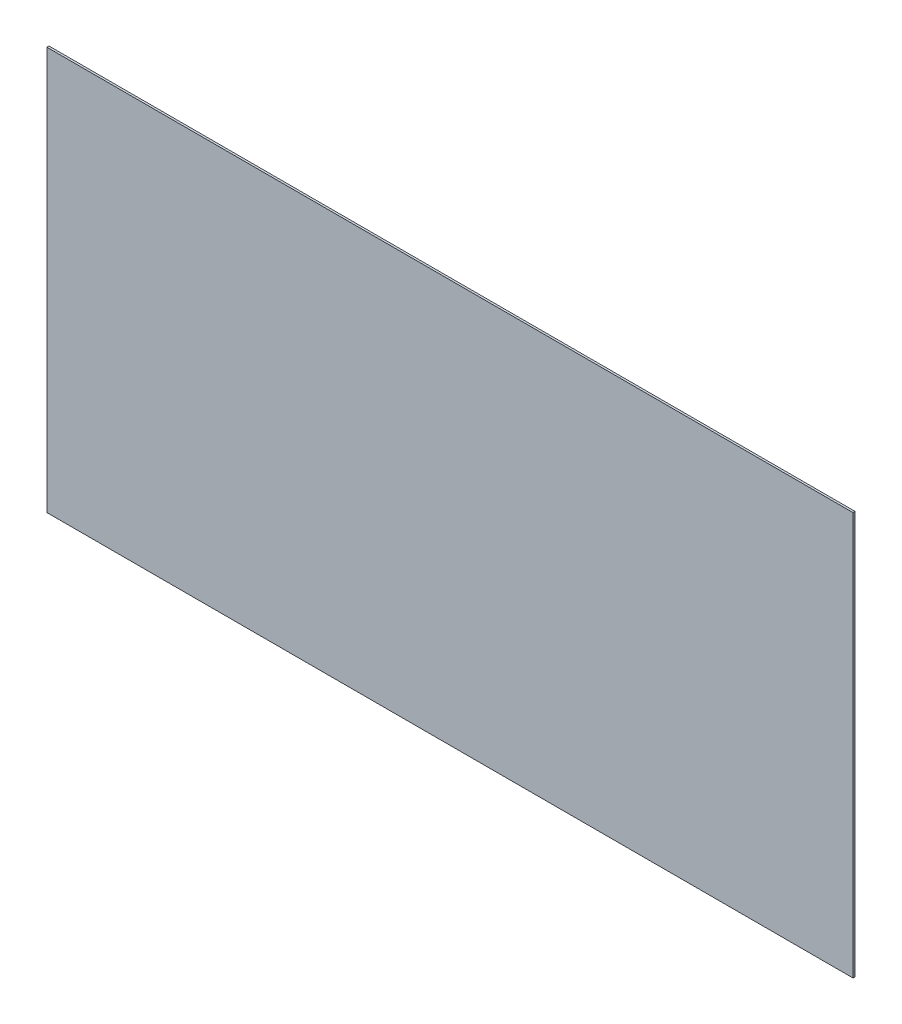
ISO-10303-21;
HEADER;
FILE_DESCRIPTION(('STEP AP214'),'2;1');
FILE_NAME('part.step','',(''),(''),'','','');
FILE_SCHEMA(('AUTOMOTIVE_DESIGN { 1 0 10303 214 1 1 1 1 }'));
ENDSEC;
DATA;
#1=APPLICATION_CONTEXT('core data for automotive mechanical design processes');
#2=APPLICATION_PROTOCOL_DEFINITION('international standard','automotive_design',2000,#1);
#3=PRODUCT_CONTEXT('',#1,'mechanical');
#4=PRODUCT('Part','Part','',(#3));
#5=PRODUCT_RELATED_PRODUCT_CATEGORY('part','',(#4));
#6=PRODUCT_DEFINITION_FORMATION('','',#4);
#7=PRODUCT_DEFINITION_CONTEXT('part definition',#1,'design');
#8=PRODUCT_DEFINITION('design','',#6,#7);
#9=PRODUCT_DEFINITION_SHAPE('','',#8);
#10=(LENGTH_UNIT() NAMED_UNIT(*) SI_UNIT(.MILLI.,.METRE.));
#11=(NAMED_UNIT(*) PLANE_ANGLE_UNIT() SI_UNIT($,.RADIAN.));
#12=(NAMED_UNIT(*) SI_UNIT($,.STERADIAN.) SOLID_ANGLE_UNIT());
#13=UNCERTAINTY_MEASURE_WITH_UNIT(LENGTH_MEASURE(1.E-05),#10,'distance_accuracy_value','');
#14=(GEOMETRIC_REPRESENTATION_CONTEXT(3) GLOBAL_UNCERTAINTY_ASSIGNED_CONTEXT((#13)) GLOBAL_UNIT_ASSIGNED_CONTEXT((#10,
#11,#12)) REPRESENTATION_CONTEXT('',''));
#15=CARTESIAN_POINT('',(0.,0.,0.));
#16=DIRECTION('',(0.,0.,1.));
#17=DIRECTION('',(1.,0.,0.));
#18=AXIS2_PLACEMENT_3D('',#15,#16,#17);
#19=CARTESIAN_POINT('',(0.,0.,4.7625));
#20=DIRECTION('',(0.,0.,1.));
#21=DIRECTION('',(1.,0.,0.));
#22=AXIS2_PLACEMENT_3D('',#19,#20,#21);
#23=PLANE('',#22);
#24=DIRECTION('',(1.,0.,0.));
#25=VECTOR('',#24,1.);
#26=CARTESIAN_POINT('',(914.4,914.4,4.7625));
#27=LINE('',#26,#25);
#28=CARTESIAN_POINT('',(-914.4,914.4,4.7625));
#29=VERTEX_POINT('',#28);
#30=CARTESIAN_POINT('',(914.4,914.4,4.7625));
#31=VERTEX_POINT('',#30);
#32=EDGE_CURVE('E68',#29,#31,#27,.T.);
#33=ORIENTED_EDGE('',*,*,#32,.F.);
#34=DIRECTION('',(0.,1.,0.));
#35=VECTOR('',#34,1.);
#36=CARTESIAN_POINT('',(-914.4,914.4,4.7625));
#37=LINE('',#36,#35);
#38=CARTESIAN_POINT('',(-914.4,0.,4.7625));
#39=VERTEX_POINT('',#38);
#40=EDGE_CURVE('E20',#39,#29,#37,.T.);
#41=ORIENTED_EDGE('',*,*,#40,.F.);
#42=DIRECTION('',(1.,0.,0.));
#43=VECTOR('',#42,1.);
#44=CARTESIAN_POINT('',(-914.4,0.,4.7625));
#45=LINE('',#44,#43);
#46=CARTESIAN_POINT('',(914.4,0.,4.7625));
#47=VERTEX_POINT('',#46);
#48=EDGE_CURVE('E58',#47,#39,#45,.F.);
#49=ORIENTED_EDGE('',*,*,#48,.F.);
#50=DIRECTION('',(0.,1.,0.));
#51=VECTOR('',#50,1.);
#52=CARTESIAN_POINT('',(914.4,0.,4.7625));
#53=LINE('',#52,#51);
#54=EDGE_CURVE('E53',#31,#47,#53,.F.);
#55=ORIENTED_EDGE('',*,*,#54,.F.);
#56=EDGE_LOOP('',(#33,#41,#49,#55));
#57=FACE_BOUND('',#56,.T.);
#58=ADVANCED_FACE('F17',(#57),#23,.T.);
#59=CARTESIAN_POINT('',(-914.4,914.4,0.));
#60=DIRECTION('',(-1.,0.,0.));
#61=DIRECTION('',(0.,0.,1.));
#62=AXIS2_PLACEMENT_3D('',#59,#60,#61);
#63=PLANE('',#62);
#64=DIRECTION('',(0.,0.,1.));
#65=VECTOR('',#64,1.);
#66=CARTESIAN_POINT('',(-914.4,914.4,0.));
#67=LINE('',#66,#65);
#68=CARTESIAN_POINT('',(-914.4,914.4,0.));
#69=VERTEX_POINT('',#68);
#70=EDGE_CURVE('E79',#69,#29,#67,.T.);
#71=ORIENTED_EDGE('',*,*,#70,.F.);
#72=DIRECTION('',(0.,1.,0.));
#73=VECTOR('',#72,1.);
#74=CARTESIAN_POINT('',(-914.4,0.,0.));
#75=LINE('',#74,#73);
#76=CARTESIAN_POINT('',(-914.4,0.,0.));
#77=VERTEX_POINT('',#76);
#78=EDGE_CURVE('E74',#69,#77,#75,.F.);
#79=ORIENTED_EDGE('',*,*,#78,.T.);
#80=DIRECTION('',(0.,0.,-1.));
#81=VECTOR('',#80,1.);
#82=CARTESIAN_POINT('',(-914.4,0.,0.));
#83=LINE('',#82,#81);
#84=EDGE_CURVE('E63',#39,#77,#83,.T.);
#85=ORIENTED_EDGE('',*,*,#84,.F.);
#86=ORIENTED_EDGE('',*,*,#40,.T.);
#87=EDGE_LOOP('',(#71,#79,#85,#86));
#88=FACE_BOUND('',#87,.T.);
#89=ADVANCED_FACE('F73',(#88),#63,.T.);
#90=CARTESIAN_POINT('',(-914.4,0.,0.));
#91=DIRECTION('',(0.,-1.,0.));
#92=DIRECTION('',(0.,0.,-1.));
#93=AXIS2_PLACEMENT_3D('',#90,#91,#92);
#94=PLANE('',#93);
#95=ORIENTED_EDGE('',*,*,#84,.T.);
#96=DIRECTION('',(1.,0.,0.));
#97=VECTOR('',#96,1.);
#98=CARTESIAN_POINT('',(0.,0.,0.));
#99=LINE('',#98,#97);
#100=CARTESIAN_POINT('',(914.4,0.,0.));
#101=VERTEX_POINT('',#100);
#102=EDGE_CURVE('E84',#77,#101,#99,.T.);
#103=ORIENTED_EDGE('',*,*,#102,.T.);
#104=DIRECTION('',(0.,0.,-1.));
#105=VECTOR('',#104,1.);
#106=CARTESIAN_POINT('',(914.4,0.,0.));
#107=LINE('',#106,#105);
#108=EDGE_CURVE('E65',#47,#101,#107,.T.);
#109=ORIENTED_EDGE('',*,*,#108,.F.);
#110=ORIENTED_EDGE('',*,*,#48,.T.);
#111=EDGE_LOOP('',(#95,#103,#109,#110));
#112=FACE_BOUND('',#111,.T.);
#113=ADVANCED_FACE('F60',(#112),#94,.T.);
#114=CARTESIAN_POINT('',(914.4,0.,0.));
#115=DIRECTION('',(1.,0.,0.));
#116=DIRECTION('',(0.,0.,-1.));
#117=AXIS2_PLACEMENT_3D('',#114,#115,#116);
#118=PLANE('',#117);
#119=ORIENTED_EDGE('',*,*,#108,.T.);
#120=DIRECTION('',(0.,1.,0.));
#121=VECTOR('',#120,1.);
#122=CARTESIAN_POINT('',(914.4,0.,0.));
#123=LINE('',#122,#121);
#124=CARTESIAN_POINT('',(914.4,914.4,0.));
#125=VERTEX_POINT('',#124);
#126=EDGE_CURVE('E26',#101,#125,#123,.T.);
#127=ORIENTED_EDGE('',*,*,#126,.T.);
#128=DIRECTION('',(0.,0.,1.));
#129=VECTOR('',#128,1.);
#130=CARTESIAN_POINT('',(914.4,914.4,0.));
#131=LINE('',#130,#129);
#132=EDGE_CURVE('E34',#31,#125,#131,.F.);
#133=ORIENTED_EDGE('',*,*,#132,.F.);
#134=ORIENTED_EDGE('',*,*,#54,.T.);
#135=EDGE_LOOP('',(#119,#127,#133,#134));
#136=FACE_BOUND('',#135,.T.);
#137=ADVANCED_FACE('F88',(#136),#118,.T.);
#138=CARTESIAN_POINT('',(914.4,914.4,0.));
#139=DIRECTION('',(0.,1.,0.));
#140=DIRECTION('',(0.,0.,1.));
#141=AXIS2_PLACEMENT_3D('',#138,#139,#140);
#142=PLANE('',#141);
#143=ORIENTED_EDGE('',*,*,#132,.T.);
#144=DIRECTION('',(1.,0.,0.));
#145=VECTOR('',#144,1.);
#146=CARTESIAN_POINT('',(0.,914.4,0.));
#147=LINE('',#146,#145);
#148=EDGE_CURVE('E11',#125,#69,#147,.F.);
#149=ORIENTED_EDGE('',*,*,#148,.T.);
#150=ORIENTED_EDGE('',*,*,#70,.T.);
#151=ORIENTED_EDGE('',*,*,#32,.T.);
#152=EDGE_LOOP('',(#143,#149,#150,#151));
#153=FACE_BOUND('',#152,.T.);
#154=ADVANCED_FACE('F91',(#153),#142,.T.);
#155=CARTESIAN_POINT('',(0.,0.,0.));
#156=DIRECTION('',(0.,0.,1.));
#157=DIRECTION('',(1.,0.,0.));
#158=AXIS2_PLACEMENT_3D('',#155,#156,#157);
#159=PLANE('',#158);
#160=ORIENTED_EDGE('',*,*,#126,.F.);
#161=ORIENTED_EDGE('',*,*,#102,.F.);
#162=ORIENTED_EDGE('',*,*,#78,.F.);
#163=ORIENTED_EDGE('',*,*,#148,.F.);
#164=EDGE_LOOP('',(#160,#161,#162,#163));
#165=FACE_BOUND('',#164,.T.);
#166=ADVANCED_FACE('F90',(#165),#159,.F.);
#167=CLOSED_SHELL('',(#58,#89,#113,#137,#154,#166));
#168=MANIFOLD_SOLID_BREP('B1',#167);
#169=ADVANCED_BREP_SHAPE_REPRESENTATION('',(#18,#168),#14);
#170=SHAPE_DEFINITION_REPRESENTATION(#9,#169);
ENDSEC;
END-ISO-10303-21;
